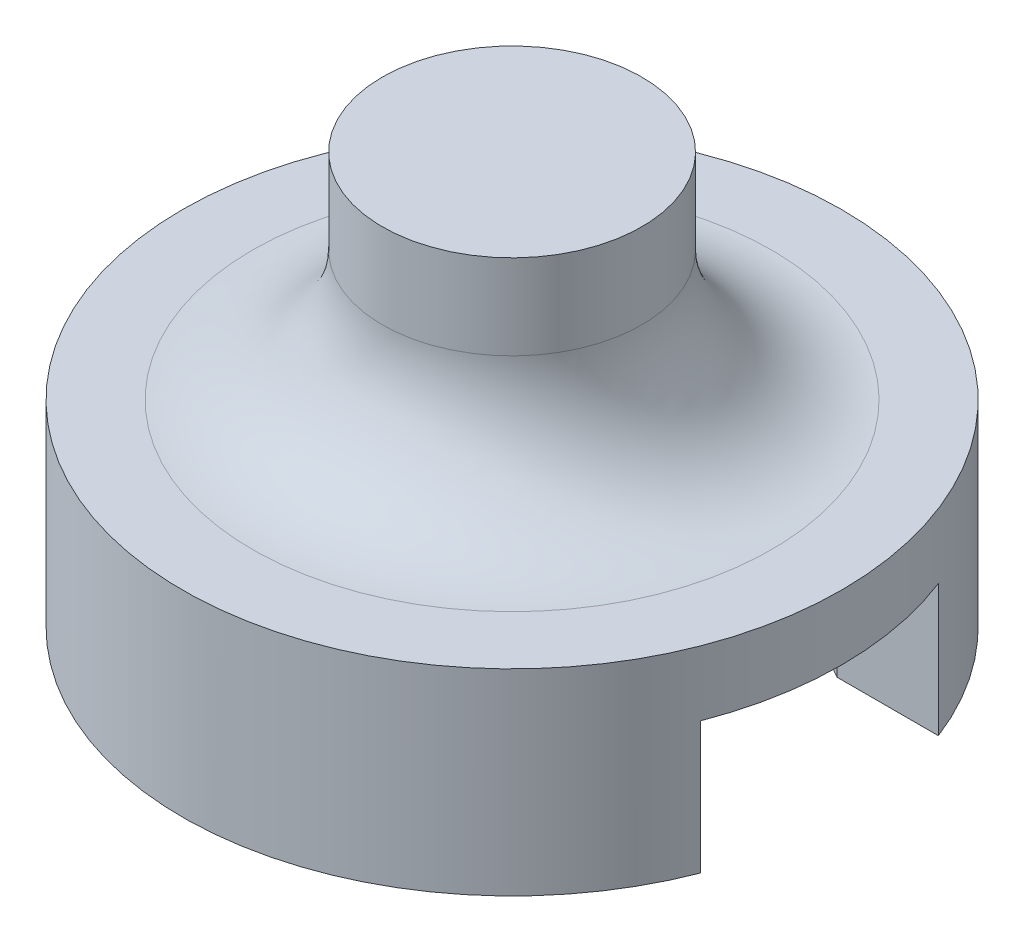
ISO-10303-21;
HEADER;
FILE_DESCRIPTION(('STEP AP214'),'2;1');
FILE_NAME('part.step','',(''),(''),'','','');
FILE_SCHEMA(('AUTOMOTIVE_DESIGN { 1 0 10303 214 1 1 1 1 }'));
ENDSEC;
DATA;
#1=APPLICATION_CONTEXT('core data for automotive mechanical design processes');
#2=APPLICATION_PROTOCOL_DEFINITION('international standard','automotive_design',2000,#1);
#3=PRODUCT_CONTEXT('',#1,'mechanical');
#4=PRODUCT('Part','Part','',(#3));
#5=PRODUCT_RELATED_PRODUCT_CATEGORY('part','',(#4));
#6=PRODUCT_DEFINITION_FORMATION('','',#4);
#7=PRODUCT_DEFINITION_CONTEXT('part definition',#1,'design');
#8=PRODUCT_DEFINITION('design','',#6,#7);
#9=PRODUCT_DEFINITION_SHAPE('','',#8);
#10=(LENGTH_UNIT() NAMED_UNIT(*) SI_UNIT(.MILLI.,.METRE.));
#11=(NAMED_UNIT(*) PLANE_ANGLE_UNIT() SI_UNIT($,.RADIAN.));
#12=(NAMED_UNIT(*) SI_UNIT($,.STERADIAN.) SOLID_ANGLE_UNIT());
#13=UNCERTAINTY_MEASURE_WITH_UNIT(LENGTH_MEASURE(1.E-05),#10,'distance_accuracy_value','');
#14=(GEOMETRIC_REPRESENTATION_CONTEXT(3) GLOBAL_UNCERTAINTY_ASSIGNED_CONTEXT((#13)) GLOBAL_UNIT_ASSIGNED_CONTEXT((#10,
#11,#12)) REPRESENTATION_CONTEXT('',''));
#15=CARTESIAN_POINT('',(0.,0.,0.));
#16=DIRECTION('',(0.,0.,1.));
#17=DIRECTION('',(1.,0.,0.));
#18=AXIS2_PLACEMENT_3D('',#15,#16,#17);
#19=CARTESIAN_POINT('',(2.51046511627907,25.25346,12.7));
#20=DIRECTION('',(0.,-1.,0.));
#21=DIRECTION('',(1.,0.,0.));
#22=AXIS2_PLACEMENT_3D('',#19,#20,#21);
#23=CYLINDRICAL_SURFACE('',#22,12.7);
#24=DIRECTION('',(0.,-1.,0.));
#25=VECTOR('',#24,1.);
#26=CARTESIAN_POINT('',(14.3548181132421,25.25346,8.11728223830729));
#27=LINE('',#26,#25);
#28=CARTESIAN_POINT('',(14.3548181132421,25.25346,8.11728223830729));
#29=VERTEX_POINT('',#28);
#30=CARTESIAN_POINT('',(14.3548181132421,20.17346,8.11728223830729));
#31=VERTEX_POINT('',#30);
#32=EDGE_CURVE('E307',#29,#31,#27,.T.);
#33=ORIENTED_EDGE('',*,*,#32,.T.);
#34=CARTESIAN_POINT('',(2.51046511627907,20.17346,12.7));
#35=DIRECTION('',(0.,1.,0.));
#36=DIRECTION('',(-1.,0.,0.));
#37=AXIS2_PLACEMENT_3D('',#34,#35,#36);
#38=CIRCLE('',#37,12.7);
#39=CARTESIAN_POINT('',(14.3548181132421,20.17346,17.2827177616926));
#40=VERTEX_POINT('',#39);
#41=EDGE_CURVE('E57',#31,#40,#38,.T.);
#42=ORIENTED_EDGE('',*,*,#41,.T.);
#43=DIRECTION('',(0.,-1.,0.));
#44=VECTOR('',#43,1.);
#45=CARTESIAN_POINT('',(14.3548181132421,25.25346,17.2827177616926));
#46=LINE('',#45,#44);
#47=CARTESIAN_POINT('',(14.3548181132421,25.25346,17.2827177616926));
#48=VERTEX_POINT('',#47);
#49=EDGE_CURVE('E123',#48,#40,#46,.T.);
#50=ORIENTED_EDGE('',*,*,#49,.F.);
#51=CARTESIAN_POINT('',(2.51046511627907,25.25346,12.7));
#52=DIRECTION('',(0.,1.,0.));
#53=DIRECTION('',(-1.,0.,0.));
#54=AXIS2_PLACEMENT_3D('',#51,#52,#53);
#55=CIRCLE('',#54,12.7);
#56=EDGE_CURVE('E105',#48,#29,#55,.T.);
#57=ORIENTED_EDGE('',*,*,#56,.T.);
#58=EDGE_LOOP('',(#33,#42,#50,#57));
#59=FACE_BOUND('',#58,.T.);
#60=CARTESIAN_POINT('',(2.51046511627907,27.75346,12.7));
#61=DIRECTION('',(0.,1.,0.));
#62=DIRECTION('',(-1.,0.,0.));
#63=AXIS2_PLACEMENT_3D('',#60,#61,#62);
#64=CIRCLE('',#63,12.7);
#65=CARTESIAN_POINT('',(-10.1895348837209,27.75346,12.7));
#66=VERTEX_POINT('',#65);
#67=EDGE_CURVE('E116',#66,#66,#64,.T.);
#68=ORIENTED_EDGE('',*,*,#67,.F.);
#69=EDGE_LOOP('',(#68));
#70=FACE_BOUND('',#69,.T.);
#71=ADVANCED_FACE('F41',(#59,#70),#23,.T.);
#72=CARTESIAN_POINT('',(0.,25.25346,17.2827177616926));
#73=DIRECTION('',(0.,0.,1.));
#74=DIRECTION('',(1.,0.,0.));
#75=AXIS2_PLACEMENT_3D('',#72,#73,#74);
#76=PLANE('',#75);
#77=DIRECTION('',(-1.,0.,0.));
#78=VECTOR('',#77,1.);
#79=CARTESIAN_POINT('',(0.,20.17346,17.2827177616926));
#80=LINE('',#79,#78);
#81=CARTESIAN_POINT('',(10.4479651162792,20.17346,17.2827177616926));
#82=VERTEX_POINT('',#81);
#83=EDGE_CURVE('E283',#40,#82,#80,.T.);
#84=ORIENTED_EDGE('',*,*,#83,.T.);
#85=DIRECTION('',(0.,-1.,0.));
#86=VECTOR('',#85,1.);
#87=CARTESIAN_POINT('',(10.4479651162792,25.25346,17.2827177616926));
#88=LINE('',#87,#86);
#89=CARTESIAN_POINT('',(10.4479651162792,25.25346,17.2827177616926));
#90=VERTEX_POINT('',#89);
#91=EDGE_CURVE('E125',#90,#82,#88,.T.);
#92=ORIENTED_EDGE('',*,*,#91,.F.);
#93=DIRECTION('',(-1.,0.,0.));
#94=VECTOR('',#93,1.);
#95=CARTESIAN_POINT('',(0.,25.25346,17.2827177616926));
#96=LINE('',#95,#94);
#97=EDGE_CURVE('E108',#48,#90,#96,.T.);
#98=ORIENTED_EDGE('',*,*,#97,.F.);
#99=ORIENTED_EDGE('',*,*,#49,.T.);
#100=EDGE_LOOP('',(#84,#92,#98,#99));
#101=FACE_BOUND('',#100,.T.);
#102=ADVANCED_FACE('F122',(#101),#76,.F.);
#103=CARTESIAN_POINT('',(10.0956275931009,25.25346,17.4861399255451));
#104=DIRECTION('',(-0.5,0.,-0.866025403784439));
#105=DIRECTION('',(-0.866025403784439,0.,0.5));
#106=AXIS2_PLACEMENT_3D('',#103,#104,#105);
#107=PLANE('',#106);
#108=DIRECTION('',(0.866025403784439,0.,-0.5));
#109=VECTOR('',#108,1.);
#110=CARTESIAN_POINT('',(10.0956275931009,20.17346,17.4861399255451));
#111=LINE('',#110,#109);
#112=CARTESIAN_POINT('',(2.51046511627918,20.17346,21.8654355233852));
#113=VERTEX_POINT('',#112);
#114=EDGE_CURVE('E286',#113,#82,#111,.T.);
#115=ORIENTED_EDGE('',*,*,#114,.F.);
#116=DIRECTION('',(0.,-1.,0.));
#117=VECTOR('',#116,1.);
#118=CARTESIAN_POINT('',(2.51046511627918,25.25346,21.8654355233852));
#119=LINE('',#118,#117);
#120=CARTESIAN_POINT('',(2.51046511627918,25.25346,21.8654355233852));
#121=VERTEX_POINT('',#120);
#122=EDGE_CURVE('E137',#121,#113,#119,.T.);
#123=ORIENTED_EDGE('',*,*,#122,.F.);
#124=DIRECTION('',(0.866025403784439,0.,-0.5));
#125=VECTOR('',#124,1.);
#126=CARTESIAN_POINT('',(10.0956275931009,25.25346,17.4861399255451));
#127=LINE('',#126,#125);
#128=EDGE_CURVE('E128',#121,#90,#127,.T.);
#129=ORIENTED_EDGE('',*,*,#128,.T.);
#130=ORIENTED_EDGE('',*,*,#91,.T.);
#131=EDGE_LOOP('',(#115,#123,#129,#130));
#132=FACE_BOUND('',#131,.T.);
#133=ADVANCED_FACE('F160',(#132),#107,.T.);
#134=CARTESIAN_POINT('',(-8.84039503496136,25.25346,15.3120133595327));
#135=DIRECTION('',(0.5,0.,-0.866025403784439));
#136=DIRECTION('',(-0.866025403784439,0.,-0.5));
#137=AXIS2_PLACEMENT_3D('',#134,#135,#136);
#138=PLANE('',#137);
#139=DIRECTION('',(0.866025403784439,0.,0.5));
#140=VECTOR('',#139,1.);
#141=CARTESIAN_POINT('',(-8.84039503496136,20.17346,15.3120133595327));
#142=LINE('',#141,#140);
#143=CARTESIAN_POINT('',(-5.42703488372084,20.17346,17.2827177616926));
#144=VERTEX_POINT('',#143);
#145=EDGE_CURVE('E311',#144,#113,#142,.T.);
#146=ORIENTED_EDGE('',*,*,#145,.F.);
#147=DIRECTION('',(0.,-1.,0.));
#148=VECTOR('',#147,1.);
#149=CARTESIAN_POINT('',(-5.42703488372084,25.25346,17.2827177616926));
#150=LINE('',#149,#148);
#151=CARTESIAN_POINT('',(-5.42703488372084,25.25346,17.2827177616926));
#152=VERTEX_POINT('',#151);
#153=EDGE_CURVE('E339',#152,#144,#150,.T.);
#154=ORIENTED_EDGE('',*,*,#153,.F.);
#155=DIRECTION('',(0.866025403784439,0.,0.5));
#156=VECTOR('',#155,1.);
#157=CARTESIAN_POINT('',(-8.84039503496136,25.25346,15.3120133595327));
#158=LINE('',#157,#156);
#159=EDGE_CURVE('E292',#152,#121,#158,.T.);
#160=ORIENTED_EDGE('',*,*,#159,.T.);
#161=ORIENTED_EDGE('',*,*,#122,.T.);
#162=EDGE_LOOP('',(#146,#154,#160,#161));
#163=FACE_BOUND('',#162,.T.);
#164=ADVANCED_FACE('F165',(#163),#138,.T.);
#165=CARTESIAN_POINT('',(-5.42703488372083,25.25346,0.));
#166=DIRECTION('',(1.,0.,0.));
#167=DIRECTION('',(0.,0.,-1.));
#168=AXIS2_PLACEMENT_3D('',#165,#166,#167);
#169=PLANE('',#168);
#170=DIRECTION('',(0.,0.,1.));
#171=VECTOR('',#170,1.);
#172=CARTESIAN_POINT('',(-5.42703488372083,20.17346,0.));
#173=LINE('',#172,#171);
#174=CARTESIAN_POINT('',(-5.42703488372083,20.17346,8.11728223830727));
#175=VERTEX_POINT('',#174);
#176=EDGE_CURVE('E314',#175,#144,#173,.T.);
#177=ORIENTED_EDGE('',*,*,#176,.F.);
#178=DIRECTION('',(0.,-1.,0.));
#179=VECTOR('',#178,1.);
#180=CARTESIAN_POINT('',(-5.42703488372083,25.25346,8.11728223830727));
#181=LINE('',#180,#179);
#182=CARTESIAN_POINT('',(-5.42703488372083,25.25346,8.11728223830727));
#183=VERTEX_POINT('',#182);
#184=EDGE_CURVE('E335',#183,#175,#181,.T.);
#185=ORIENTED_EDGE('',*,*,#184,.F.);
#186=DIRECTION('',(0.,0.,1.));
#187=VECTOR('',#186,1.);
#188=CARTESIAN_POINT('',(-5.42703488372083,25.25346,0.));
#189=LINE('',#188,#187);
#190=EDGE_CURVE('E296',#183,#152,#189,.T.);
#191=ORIENTED_EDGE('',*,*,#190,.T.);
#192=ORIENTED_EDGE('',*,*,#153,.T.);
#193=EDGE_LOOP('',(#177,#185,#191,#192));
#194=FACE_BOUND('',#193,.T.);
#195=ADVANCED_FACE('F169',(#194),#169,.T.);
#196=CARTESIAN_POINT('',(2.15812759310094,25.25346,3.73798664046717));
#197=DIRECTION('',(0.5,0.,0.866025403784439));
#198=DIRECTION('',(0.866025403784439,0.,-0.5));
#199=AXIS2_PLACEMENT_3D('',#196,#197,#198);
#200=PLANE('',#199);
#201=DIRECTION('',(-0.866025403784439,0.,0.5));
#202=VECTOR('',#201,1.);
#203=CARTESIAN_POINT('',(2.15812759310094,20.17346,3.73798664046717));
#204=LINE('',#203,#202);
#205=CARTESIAN_POINT('',(2.51046511627914,20.17346,3.53456447661463));
#206=VERTEX_POINT('',#205);
#207=EDGE_CURVE('E317',#206,#175,#204,.T.);
#208=ORIENTED_EDGE('',*,*,#207,.F.);
#209=DIRECTION('',(0.,-1.,0.));
#210=VECTOR('',#209,1.);
#211=CARTESIAN_POINT('',(2.51046511627914,25.25346,3.53456447661463));
#212=LINE('',#211,#210);
#213=CARTESIAN_POINT('',(2.51046511627914,25.25346,3.53456447661463));
#214=VERTEX_POINT('',#213);
#215=EDGE_CURVE('E331',#214,#206,#212,.T.);
#216=ORIENTED_EDGE('',*,*,#215,.F.);
#217=DIRECTION('',(-0.866025403784439,0.,0.5));
#218=VECTOR('',#217,1.);
#219=CARTESIAN_POINT('',(2.15812759310094,25.25346,3.73798664046717));
#220=LINE('',#219,#218);
#221=EDGE_CURVE('E300',#214,#183,#220,.T.);
#222=ORIENTED_EDGE('',*,*,#221,.T.);
#223=ORIENTED_EDGE('',*,*,#184,.T.);
#224=EDGE_LOOP('',(#208,#216,#222,#223));
#225=FACE_BOUND('',#224,.T.);
#226=ADVANCED_FACE('F173',(#225),#200,.T.);
#227=CARTESIAN_POINT('',(-0.902895034961375,25.25346,1.56386007445477));
#228=DIRECTION('',(-0.5,0.,0.866025403784439));
#229=DIRECTION('',(0.866025403784439,0.,0.5));
#230=AXIS2_PLACEMENT_3D('',#227,#228,#229);
#231=PLANE('',#230);
#232=DIRECTION('',(-0.866025403784439,0.,-0.5));
#233=VECTOR('',#232,1.);
#234=CARTESIAN_POINT('',(-0.902895034961374,20.17346,1.56386007445477));
#235=LINE('',#234,#233);
#236=CARTESIAN_POINT('',(10.4479651162792,20.17346,8.11728223830729));
#237=VERTEX_POINT('',#236);
#238=EDGE_CURVE('E320',#237,#206,#235,.T.);
#239=ORIENTED_EDGE('',*,*,#238,.F.);
#240=DIRECTION('',(0.,-1.,0.));
#241=VECTOR('',#240,1.);
#242=CARTESIAN_POINT('',(10.4479651162792,25.25346,8.11728223830729));
#243=LINE('',#242,#241);
#244=CARTESIAN_POINT('',(10.4479651162792,25.25346,8.11728223830729));
#245=VERTEX_POINT('',#244);
#246=EDGE_CURVE('E327',#245,#237,#243,.T.);
#247=ORIENTED_EDGE('',*,*,#246,.F.);
#248=DIRECTION('',(-0.866025403784439,0.,-0.5));
#249=VECTOR('',#248,1.);
#250=CARTESIAN_POINT('',(-0.902895034961375,25.25346,1.56386007445477));
#251=LINE('',#250,#249);
#252=EDGE_CURVE('E65',#245,#214,#251,.T.);
#253=ORIENTED_EDGE('',*,*,#252,.T.);
#254=ORIENTED_EDGE('',*,*,#215,.T.);
#255=EDGE_LOOP('',(#239,#247,#253,#254));
#256=FACE_BOUND('',#255,.T.);
#257=ADVANCED_FACE('F177',(#256),#231,.T.);
#258=CARTESIAN_POINT('',(0.,25.25346,8.11728223830729));
#259=DIRECTION('',(0.,0.,1.));
#260=DIRECTION('',(1.,0.,0.));
#261=AXIS2_PLACEMENT_3D('',#258,#259,#260);
#262=PLANE('',#261);
#263=DIRECTION('',(-1.,0.,0.));
#264=VECTOR('',#263,1.);
#265=CARTESIAN_POINT('',(0.,20.17346,8.11728223830729));
#266=LINE('',#265,#264);
#267=EDGE_CURVE('E129',#31,#237,#266,.T.);
#268=ORIENTED_EDGE('',*,*,#267,.F.);
#269=ORIENTED_EDGE('',*,*,#32,.F.);
#270=DIRECTION('',(-1.,0.,0.));
#271=VECTOR('',#270,1.);
#272=CARTESIAN_POINT('',(0.,25.25346,8.11728223830729));
#273=LINE('',#272,#271);
#274=EDGE_CURVE('E111',#29,#245,#273,.T.);
#275=ORIENTED_EDGE('',*,*,#274,.T.);
#276=ORIENTED_EDGE('',*,*,#246,.T.);
#277=EDGE_LOOP('',(#268,#269,#275,#276));
#278=FACE_BOUND('',#277,.T.);
#279=ADVANCED_FACE('F181',(#278),#262,.T.);
#280=CARTESIAN_POINT('',(0.,20.17346,0.));
#281=DIRECTION('',(0.,-1.,0.));
#282=DIRECTION('',(1.,0.,0.));
#283=AXIS2_PLACEMENT_3D('',#280,#281,#282);
#284=PLANE('',#283);
#285=ORIENTED_EDGE('',*,*,#41,.F.);
#286=ORIENTED_EDGE('',*,*,#267,.T.);
#287=ORIENTED_EDGE('',*,*,#238,.T.);
#288=ORIENTED_EDGE('',*,*,#207,.T.);
#289=ORIENTED_EDGE('',*,*,#176,.T.);
#290=ORIENTED_EDGE('',*,*,#145,.T.);
#291=ORIENTED_EDGE('',*,*,#114,.T.);
#292=ORIENTED_EDGE('',*,*,#83,.F.);
#293=EDGE_LOOP('',(#285,#286,#287,#288,#289,#290,#291,#292));
#294=FACE_BOUND('',#293,.T.);
#295=ADVANCED_FACE('F185',(#294),#284,.T.);
#296=CARTESIAN_POINT('',(2.51046511627907,25.25346,12.7));
#297=DIRECTION('',(0.,1.,0.));
#298=DIRECTION('',(-1.,0.,0.));
#299=AXIS2_PLACEMENT_3D('',#296,#297,#298);
#300=PLANE('',#299);
#301=ORIENTED_EDGE('',*,*,#56,.F.);
#302=ORIENTED_EDGE('',*,*,#97,.T.);
#303=ORIENTED_EDGE('',*,*,#128,.F.);
#304=ORIENTED_EDGE('',*,*,#159,.F.);
#305=ORIENTED_EDGE('',*,*,#190,.F.);
#306=ORIENTED_EDGE('',*,*,#221,.F.);
#307=ORIENTED_EDGE('',*,*,#252,.F.);
#308=ORIENTED_EDGE('',*,*,#274,.F.);
#309=EDGE_LOOP('',(#301,#302,#303,#304,#305,#306,#307,#308));
#310=FACE_BOUND('',#309,.T.);
#311=ADVANCED_FACE('F107',(#310),#300,.F.);
#312=CARTESIAN_POINT('',(2.51046511627907,27.75346,12.7));
#313=DIRECTION('',(0.,1.,0.));
#314=DIRECTION('',(-1.,0.,0.));
#315=AXIS2_PLACEMENT_3D('',#312,#313,#314);
#316=PLANE('',#315);
#317=CARTESIAN_POINT('',(2.51046511627907,27.75346,12.7));
#318=DIRECTION('',(0.,1.,0.));
#319=DIRECTION('',(-1.,0.,0.));
#320=AXIS2_PLACEMENT_3D('',#317,#318,#319);
#321=CIRCLE('',#320,10.);
#322=CARTESIAN_POINT('',(-7.48953488372093,27.75346,12.7));
#323=VERTEX_POINT('',#322);
#324=EDGE_CURVE('E11',#323,#323,#321,.F.);
#325=ORIENTED_EDGE('',*,*,#324,.T.);
#326=EDGE_LOOP('',(#325));
#327=FACE_BOUND('',#326,.T.);
#328=ORIENTED_EDGE('',*,*,#67,.T.);
#329=EDGE_LOOP('',(#328));
#330=FACE_BOUND('',#329,.T.);
#331=ADVANCED_FACE('F191',(#327,#330),#316,.T.);
#332=CARTESIAN_POINT('',(2.51046511627907,36.02546,12.7));
#333=DIRECTION('',(0.,-1.,0.));
#334=DIRECTION('',(1.,0.,0.));
#335=AXIS2_PLACEMENT_3D('',#332,#333,#334);
#336=CYLINDRICAL_SURFACE('',#335,5.);
#337=CARTESIAN_POINT('',(2.51046511627907,32.75346,12.7));
#338=DIRECTION('',(0.,1.,0.));
#339=DIRECTION('',(-1.,0.,0.));
#340=AXIS2_PLACEMENT_3D('',#337,#338,#339);
#341=CIRCLE('',#340,5.);
#342=CARTESIAN_POINT('',(-2.48953488372093,32.75346,12.7));
#343=VERTEX_POINT('',#342);
#344=EDGE_CURVE('E50',#343,#343,#341,.T.);
#345=ORIENTED_EDGE('',*,*,#344,.T.);
#346=EDGE_LOOP('',(#345));
#347=FACE_BOUND('',#346,.T.);
#348=CARTESIAN_POINT('',(2.51046511627907,36.02546,12.7));
#349=DIRECTION('',(0.,1.,0.));
#350=DIRECTION('',(-1.,0.,0.));
#351=AXIS2_PLACEMENT_3D('',#348,#349,#350);
#352=CIRCLE('',#351,5.);
#353=CARTESIAN_POINT('',(-2.48953488372093,36.02546,12.7));
#354=VERTEX_POINT('',#353);
#355=EDGE_CURVE('E117',#354,#354,#352,.T.);
#356=ORIENTED_EDGE('',*,*,#355,.F.);
#357=EDGE_LOOP('',(#356));
#358=FACE_BOUND('',#357,.T.);
#359=ADVANCED_FACE('F144',(#347,#358),#336,.T.);
#360=CARTESIAN_POINT('',(0.,36.02546,0.));
#361=DIRECTION('',(0.,1.,0.));
#362=DIRECTION('',(-1.,0.,0.));
#363=AXIS2_PLACEMENT_3D('',#360,#361,#362);
#364=PLANE('',#363);
#365=ORIENTED_EDGE('',*,*,#355,.T.);
#366=EDGE_LOOP('',(#365));
#367=FACE_BOUND('',#366,.T.);
#368=ADVANCED_FACE('F148',(#367),#364,.T.);
#369=CARTESIAN_POINT('',(2.51046511627907,32.75346,12.7));
#370=DIRECTION('',(0.,1.,0.));
#371=DIRECTION('',(-1.,0.,0.));
#372=AXIS2_PLACEMENT_3D('',#369,#370,#371);
#373=TOROIDAL_SURFACE('',#372,10.,5.);
#374=ORIENTED_EDGE('',*,*,#324,.F.);
#375=EDGE_LOOP('',(#374));
#376=FACE_BOUND('',#375,.T.);
#377=ORIENTED_EDGE('',*,*,#344,.F.);
#378=EDGE_LOOP('',(#377));
#379=FACE_BOUND('',#378,.T.);
#380=ADVANCED_FACE('F43',(#376,#379),#373,.F.);
#381=CLOSED_SHELL('',(#71,#102,#133,#164,#195,#226,#257,#279,#295,#311,#331,#359,#368,#380));
#382=MANIFOLD_SOLID_BREP('B2',#381);
#383=ADVANCED_BREP_SHAPE_REPRESENTATION('',(#18,#382),#14);
#384=SHAPE_DEFINITION_REPRESENTATION(#9,#383);
ENDSEC;
END-ISO-10303-21;
